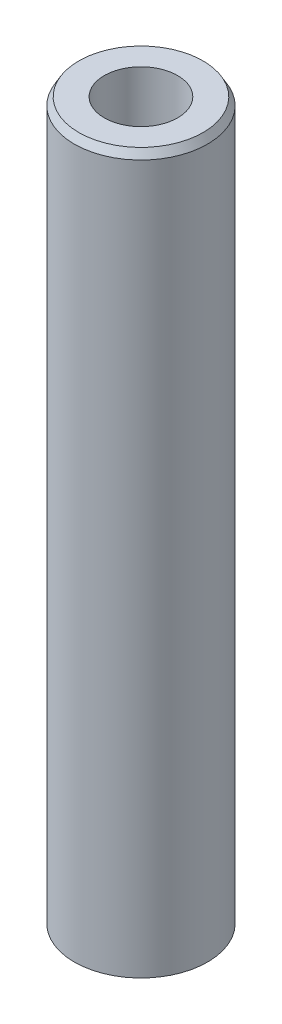
ISO-10303-21;
HEADER;
FILE_DESCRIPTION(('STEP AP214'),'2;1');
FILE_NAME('part.step','',(''),(''),'','','');
FILE_SCHEMA(('AUTOMOTIVE_DESIGN { 1 0 10303 214 1 1 1 1 }'));
ENDSEC;
DATA;
#1=APPLICATION_CONTEXT('core data for automotive mechanical design processes');
#2=APPLICATION_PROTOCOL_DEFINITION('international standard','automotive_design',2000,#1);
#3=PRODUCT_CONTEXT('',#1,'mechanical');
#4=PRODUCT('Part','Part','',(#3));
#5=PRODUCT_RELATED_PRODUCT_CATEGORY('part','',(#4));
#6=PRODUCT_DEFINITION_FORMATION('','',#4);
#7=PRODUCT_DEFINITION_CONTEXT('part definition',#1,'design');
#8=PRODUCT_DEFINITION('design','',#6,#7);
#9=PRODUCT_DEFINITION_SHAPE('','',#8);
#10=(LENGTH_UNIT() NAMED_UNIT(*) SI_UNIT(.MILLI.,.METRE.));
#11=(NAMED_UNIT(*) PLANE_ANGLE_UNIT() SI_UNIT($,.RADIAN.));
#12=(NAMED_UNIT(*) SI_UNIT($,.STERADIAN.) SOLID_ANGLE_UNIT());
#13=UNCERTAINTY_MEASURE_WITH_UNIT(LENGTH_MEASURE(1.E-05),#10,'distance_accuracy_value','');
#14=(GEOMETRIC_REPRESENTATION_CONTEXT(3) GLOBAL_UNCERTAINTY_ASSIGNED_CONTEXT((#13)) GLOBAL_UNIT_ASSIGNED_CONTEXT((#10,
#11,#12)) REPRESENTATION_CONTEXT('',''));
#15=CARTESIAN_POINT('',(0.,0.,0.));
#16=DIRECTION('',(0.,0.,1.));
#17=DIRECTION('',(1.,0.,0.));
#18=AXIS2_PLACEMENT_3D('',#15,#16,#17);
#19=CARTESIAN_POINT('',(0.,243.446333862812,0.));
#20=DIRECTION('',(0.,-1.,0.));
#21=DIRECTION('',(0.,0.,-1.));
#22=AXIS2_PLACEMENT_3D('',#19,#20,#21);
#23=CYLINDRICAL_SURFACE('',#22,22.5);
#24=CARTESIAN_POINT('',(0.,240.81754777563,0.));
#25=DIRECTION('',(0.,1.,0.));
#26=DIRECTION('',(0.,0.,1.));
#27=AXIS2_PLACEMENT_3D('',#24,#25,#26);
#28=CIRCLE('',#27,22.5);
#29=CARTESIAN_POINT('',(0.,240.81754777563,22.5));
#30=VERTEX_POINT('',#29);
#31=EDGE_CURVE('E50',#30,#30,#28,.F.);
#32=ORIENTED_EDGE('',*,*,#31,.T.);
#33=EDGE_LOOP('',(#32));
#34=FACE_BOUND('',#33,.T.);
#35=CARTESIAN_POINT('',(0.,1.51773035507657,0.));
#36=DIRECTION('',(0.,1.,0.));
#37=DIRECTION('',(0.,0.,1.));
#38=AXIS2_PLACEMENT_3D('',#35,#36,#37);
#39=CIRCLE('',#38,22.5);
#40=CARTESIAN_POINT('',(0.,1.51773035507657,22.5));
#41=VERTEX_POINT('',#40);
#42=EDGE_CURVE('E51',#41,#41,#39,.T.);
#43=ORIENTED_EDGE('',*,*,#42,.T.);
#44=EDGE_LOOP('',(#43));
#45=FACE_BOUND('',#44,.T.);
#46=ADVANCED_FACE('F39',(#34,#45),#23,.T.);
#47=CARTESIAN_POINT('',(0.,243.446333862812,0.));
#48=DIRECTION('',(0.,1.,0.));
#49=DIRECTION('',(0.,0.,1.));
#50=AXIS2_PLACEMENT_3D('',#47,#48,#49);
#51=PLANE('',#50);
#52=CARTESIAN_POINT('',(0.,243.446333862812,0.));
#53=DIRECTION('',(0.,1.,0.));
#54=DIRECTION('',(0.,0.,1.));
#55=AXIS2_PLACEMENT_3D('',#52,#53,#54);
#56=CIRCLE('',#55,20.9822696449234);
#57=CARTESIAN_POINT('',(0.,243.446333862812,20.9822696449234));
#58=VERTEX_POINT('',#57);
#59=EDGE_CURVE('E54',#58,#58,#56,.T.);
#60=ORIENTED_EDGE('',*,*,#59,.T.);
#61=EDGE_LOOP('',(#60));
#62=FACE_BOUND('',#61,.T.);
#63=CARTESIAN_POINT('',(0.,243.446333862812,0.));
#64=DIRECTION('',(0.,1.,0.));
#65=DIRECTION('',(0.,0.,1.));
#66=AXIS2_PLACEMENT_3D('',#63,#64,#65);
#67=CIRCLE('',#66,12.3913219508635);
#68=CARTESIAN_POINT('',(0.,243.446333862812,12.3913219508635));
#69=VERTEX_POINT('',#68);
#70=EDGE_CURVE('E58',#69,#69,#67,.T.);
#71=ORIENTED_EDGE('',*,*,#70,.F.);
#72=EDGE_LOOP('',(#71));
#73=FACE_BOUND('',#72,.T.);
#74=ADVANCED_FACE('F69',(#62,#73),#51,.T.);
#75=CARTESIAN_POINT('',(0.,0.,0.));
#76=DIRECTION('',(0.,1.,0.));
#77=DIRECTION('',(0.,0.,1.));
#78=AXIS2_PLACEMENT_3D('',#75,#76,#77);
#79=PLANE('',#78);
#80=CARTESIAN_POINT('',(0.,0.,0.));
#81=DIRECTION('',(0.,1.,0.));
#82=DIRECTION('',(0.,0.,1.));
#83=AXIS2_PLACEMENT_3D('',#80,#81,#82);
#84=CIRCLE('',#83,19.8712139128178);
#85=CARTESIAN_POINT('',(0.,0.,19.8712139128178));
#86=VERTEX_POINT('',#85);
#87=EDGE_CURVE('E10',#86,#86,#84,.F.);
#88=ORIENTED_EDGE('',*,*,#87,.T.);
#89=EDGE_LOOP('',(#88));
#90=FACE_BOUND('',#89,.T.);
#91=CARTESIAN_POINT('',(0.,0.,0.));
#92=DIRECTION('',(0.,1.,0.));
#93=DIRECTION('',(0.,0.,1.));
#94=AXIS2_PLACEMENT_3D('',#91,#92,#93);
#95=CIRCLE('',#94,12.3913219508635);
#96=CARTESIAN_POINT('',(0.,0.,12.3913219508635));
#97=VERTEX_POINT('',#96);
#98=EDGE_CURVE('E63',#97,#97,#95,.T.);
#99=ORIENTED_EDGE('',*,*,#98,.T.);
#100=EDGE_LOOP('',(#99));
#101=FACE_BOUND('',#100,.T.);
#102=ADVANCED_FACE('F75',(#90,#101),#79,.F.);
#103=CARTESIAN_POINT('',(0.,243.446333862812,0.));
#104=DIRECTION('',(0.,-1.,0.));
#105=DIRECTION('',(0.,0.,-1.));
#106=AXIS2_PLACEMENT_3D('',#103,#104,#105);
#107=CYLINDRICAL_SURFACE('',#106,12.3913219508635);
#108=ORIENTED_EDGE('',*,*,#70,.T.);
#109=EDGE_LOOP('',(#108));
#110=FACE_BOUND('',#109,.T.);
#111=ORIENTED_EDGE('',*,*,#98,.F.);
#112=EDGE_LOOP('',(#111));
#113=FACE_BOUND('',#112,.T.);
#114=ADVANCED_FACE('F70',(#110,#113),#107,.F.);
#115=CARTESIAN_POINT('',(0.,243.446333862812,0.));
#116=DIRECTION('',(0.,-1.,0.));
#117=DIRECTION('',(0.,0.,-1.));
#118=AXIS2_PLACEMENT_3D('',#115,#116,#117);
#119=CONICAL_SURFACE('',#118,20.9822696449234,0.523598775598293);
#120=ORIENTED_EDGE('',*,*,#31,.F.);
#121=EDGE_LOOP('',(#120));
#122=FACE_BOUND('',#121,.T.);
#123=ORIENTED_EDGE('',*,*,#59,.F.);
#124=EDGE_LOOP('',(#123));
#125=FACE_BOUND('',#124,.T.);
#126=ADVANCED_FACE('F81',(#122,#125),#119,.T.);
#127=CARTESIAN_POINT('',(0.,1.51773035507657,0.));
#128=DIRECTION('',(0.,1.,0.));
#129=DIRECTION('',(0.,0.,1.));
#130=AXIS2_PLACEMENT_3D('',#127,#128,#129);
#131=CONICAL_SURFACE('',#130,22.5,1.0471975511966);
#132=ORIENTED_EDGE('',*,*,#87,.F.);
#133=EDGE_LOOP('',(#132));
#134=FACE_BOUND('',#133,.T.);
#135=ORIENTED_EDGE('',*,*,#42,.F.);
#136=EDGE_LOOP('',(#135));
#137=FACE_BOUND('',#136,.T.);
#138=ADVANCED_FACE('F45',(#134,#137),#131,.T.);
#139=CLOSED_SHELL('',(#46,#74,#102,#114,#126,#138));
#140=MANIFOLD_SOLID_BREP('B2',#139);
#141=ADVANCED_BREP_SHAPE_REPRESENTATION('',(#18,#140),#14);
#142=SHAPE_DEFINITION_REPRESENTATION(#9,#141);
ENDSEC;
END-ISO-10303-21;
